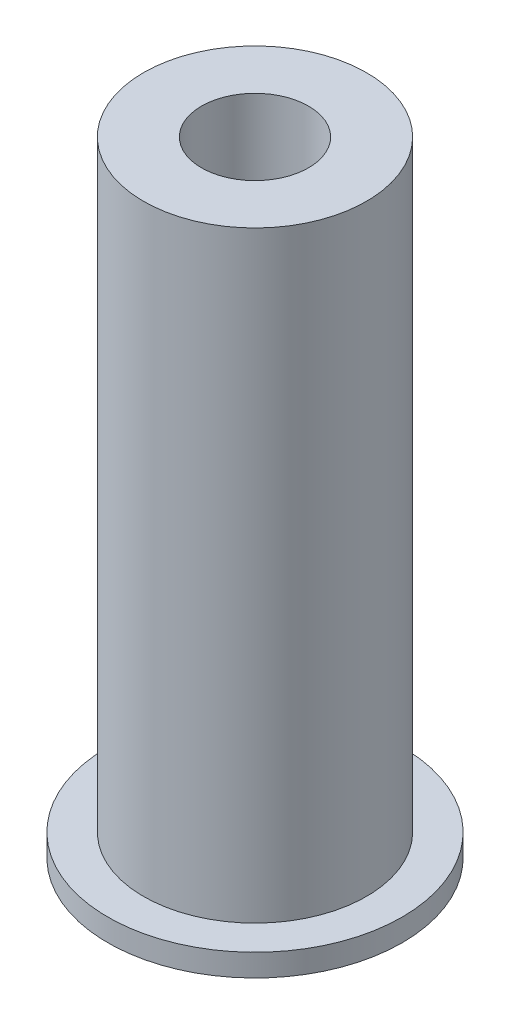
ISO-10303-21;
HEADER;
FILE_DESCRIPTION(('STEP AP214'),'2;1');
FILE_NAME('part.step','',(''),(''),'','','');
FILE_SCHEMA(('AUTOMOTIVE_DESIGN { 1 0 10303 214 1 1 1 1 }'));
ENDSEC;
DATA;
#1=APPLICATION_CONTEXT('core data for automotive mechanical design processes');
#2=APPLICATION_PROTOCOL_DEFINITION('international standard','automotive_design',2000,#1);
#3=PRODUCT_CONTEXT('',#1,'mechanical');
#4=PRODUCT('Part','Part','',(#3));
#5=PRODUCT_RELATED_PRODUCT_CATEGORY('part','',(#4));
#6=PRODUCT_DEFINITION_FORMATION('','',#4);
#7=PRODUCT_DEFINITION_CONTEXT('part definition',#1,'design');
#8=PRODUCT_DEFINITION('design','',#6,#7);
#9=PRODUCT_DEFINITION_SHAPE('','',#8);
#10=(LENGTH_UNIT() NAMED_UNIT(*) SI_UNIT(.MILLI.,.METRE.));
#11=(NAMED_UNIT(*) PLANE_ANGLE_UNIT() SI_UNIT($,.RADIAN.));
#12=(NAMED_UNIT(*) SI_UNIT($,.STERADIAN.) SOLID_ANGLE_UNIT());
#13=UNCERTAINTY_MEASURE_WITH_UNIT(LENGTH_MEASURE(1.E-05),#10,'distance_accuracy_value','');
#14=(GEOMETRIC_REPRESENTATION_CONTEXT(3) GLOBAL_UNCERTAINTY_ASSIGNED_CONTEXT((#13)) GLOBAL_UNIT_ASSIGNED_CONTEXT((#10,
#11,#12)) REPRESENTATION_CONTEXT('',''));
#15=CARTESIAN_POINT('',(0.,0.,0.));
#16=DIRECTION('',(0.,0.,1.));
#17=DIRECTION('',(1.,0.,0.));
#18=AXIS2_PLACEMENT_3D('',#15,#16,#17);
#19=CARTESIAN_POINT('',(0.,0.,0.));
#20=DIRECTION('',(0.,1.,0.));
#21=DIRECTION('',(-1.,0.,0.));
#22=AXIS2_PLACEMENT_3D('',#19,#20,#21);
#23=CYLINDRICAL_SURFACE('',#22,4.99999999999999);
#24=CARTESIAN_POINT('',(0.,-35.,0.));
#25=DIRECTION('',(0.,1.,0.));
#26=DIRECTION('',(-1.,0.,0.));
#27=AXIS2_PLACEMENT_3D('',#24,#25,#26);
#28=CIRCLE('',#27,5.);
#29=CARTESIAN_POINT('',(-4.99999999999998,-35.,0.));
#30=VERTEX_POINT('',#29);
#31=EDGE_CURVE('E68',#30,#30,#28,.T.);
#32=ORIENTED_EDGE('',*,*,#31,.F.);
#33=EDGE_LOOP('',(#32));
#34=FACE_BOUND('',#33,.T.);
#35=CARTESIAN_POINT('',(0.,-17.,0.));
#36=DIRECTION('',(0.,1.,0.));
#37=DIRECTION('',(-1.,0.,0.));
#38=AXIS2_PLACEMENT_3D('',#35,#36,#37);
#39=CIRCLE('',#38,4.99999999999999);
#40=CARTESIAN_POINT('',(-4.99999999999998,-17.,0.));
#41=VERTEX_POINT('',#40);
#42=EDGE_CURVE('E12',#41,#41,#39,.T.);
#43=ORIENTED_EDGE('',*,*,#42,.T.);
#44=EDGE_LOOP('',(#43));
#45=FACE_BOUND('',#44,.T.);
#46=ADVANCED_FACE('F40',(#34,#45),#23,.F.);
#47=CARTESIAN_POINT('',(0.,-17.,0.));
#48=DIRECTION('',(0.,1.,0.));
#49=DIRECTION('',(-1.,0.,0.));
#50=AXIS2_PLACEMENT_3D('',#47,#48,#49);
#51=PLANE('',#50);
#52=ORIENTED_EDGE('',*,*,#42,.F.);
#53=EDGE_LOOP('',(#52));
#54=FACE_BOUND('',#53,.T.);
#55=CARTESIAN_POINT('',(0.,-17.,0.));
#56=DIRECTION('',(0.,1.,0.));
#57=DIRECTION('',(-1.,0.,0.));
#58=AXIS2_PLACEMENT_3D('',#55,#56,#57);
#59=CIRCLE('',#58,3.);
#60=CARTESIAN_POINT('',(-2.99999999999999,-17.,0.));
#61=VERTEX_POINT('',#60);
#62=EDGE_CURVE('E46',#61,#61,#59,.T.);
#63=ORIENTED_EDGE('',*,*,#62,.T.);
#64=EDGE_LOOP('',(#63));
#65=FACE_BOUND('',#64,.T.);
#66=ADVANCED_FACE('F76',(#54,#65),#51,.F.);
#67=CARTESIAN_POINT('',(0.,0.,0.));
#68=DIRECTION('',(0.,1.,0.));
#69=DIRECTION('',(-1.,0.,0.));
#70=AXIS2_PLACEMENT_3D('',#67,#68,#69);
#71=CYLINDRICAL_SURFACE('',#70,2.99999999999999);
#72=ORIENTED_EDGE('',*,*,#62,.F.);
#73=EDGE_LOOP('',(#72));
#74=FACE_BOUND('',#73,.T.);
#75=CARTESIAN_POINT('',(0.,0.,0.));
#76=DIRECTION('',(0.,1.,0.));
#77=DIRECTION('',(-1.,0.,0.));
#78=AXIS2_PLACEMENT_3D('',#75,#76,#77);
#79=CIRCLE('',#78,2.99999999999998);
#80=CARTESIAN_POINT('',(-2.99999999999998,0.,0.));
#81=VERTEX_POINT('',#80);
#82=EDGE_CURVE('E50',#81,#81,#79,.T.);
#83=ORIENTED_EDGE('',*,*,#82,.T.);
#84=EDGE_LOOP('',(#83));
#85=FACE_BOUND('',#84,.T.);
#86=ADVANCED_FACE('F80',(#74,#85),#71,.F.);
#87=CARTESIAN_POINT('',(0.,0.,0.));
#88=DIRECTION('',(0.,-1.,0.));
#89=DIRECTION('',(1.,0.,0.));
#90=AXIS2_PLACEMENT_3D('',#87,#88,#89);
#91=PLANE('',#90);
#92=ORIENTED_EDGE('',*,*,#82,.F.);
#93=EDGE_LOOP('',(#92));
#94=FACE_BOUND('',#93,.T.);
#95=CARTESIAN_POINT('',(0.,0.,0.));
#96=DIRECTION('',(0.,1.,0.));
#97=DIRECTION('',(-1.,0.,0.));
#98=AXIS2_PLACEMENT_3D('',#95,#96,#97);
#99=CIRCLE('',#98,6.24999999999998);
#100=CARTESIAN_POINT('',(-6.24999999999998,0.,0.));
#101=VERTEX_POINT('',#100);
#102=EDGE_CURVE('E54',#101,#101,#99,.T.);
#103=ORIENTED_EDGE('',*,*,#102,.T.);
#104=EDGE_LOOP('',(#103));
#105=FACE_BOUND('',#104,.T.);
#106=ADVANCED_FACE('F85',(#94,#105),#91,.F.);
#107=CARTESIAN_POINT('',(0.,0.,0.));
#108=DIRECTION('',(0.,1.,0.));
#109=DIRECTION('',(-1.,0.,0.));
#110=AXIS2_PLACEMENT_3D('',#107,#108,#109);
#111=CYLINDRICAL_SURFACE('',#110,6.24999999999999);
#112=ORIENTED_EDGE('',*,*,#102,.F.);
#113=EDGE_LOOP('',(#112));
#114=FACE_BOUND('',#113,.T.);
#115=CARTESIAN_POINT('',(0.,-33.75,0.));
#116=DIRECTION('',(0.,1.,0.));
#117=DIRECTION('',(-1.,0.,0.));
#118=AXIS2_PLACEMENT_3D('',#115,#116,#117);
#119=CIRCLE('',#118,6.25);
#120=CARTESIAN_POINT('',(-6.24999999999998,-33.75,0.));
#121=VERTEX_POINT('',#120);
#122=EDGE_CURVE('E59',#121,#121,#119,.T.);
#123=ORIENTED_EDGE('',*,*,#122,.T.);
#124=EDGE_LOOP('',(#123));
#125=FACE_BOUND('',#124,.T.);
#126=ADVANCED_FACE('F91',(#114,#125),#111,.T.);
#127=CARTESIAN_POINT('',(0.,-33.75,0.));
#128=DIRECTION('',(0.,1.,0.));
#129=DIRECTION('',(-1.,0.,0.));
#130=AXIS2_PLACEMENT_3D('',#127,#128,#129);
#131=PLANE('',#130);
#132=CARTESIAN_POINT('',(0.,-33.75,0.));
#133=DIRECTION('',(0.,1.,0.));
#134=DIRECTION('',(-1.,0.,0.));
#135=AXIS2_PLACEMENT_3D('',#132,#133,#134);
#136=CIRCLE('',#135,8.25000000000001);
#137=CARTESIAN_POINT('',(-8.24999999999999,-33.75,0.));
#138=VERTEX_POINT('',#137);
#139=EDGE_CURVE('E62',#138,#138,#136,.T.);
#140=ORIENTED_EDGE('',*,*,#139,.T.);
#141=EDGE_LOOP('',(#140));
#142=FACE_BOUND('',#141,.T.);
#143=ORIENTED_EDGE('',*,*,#122,.F.);
#144=EDGE_LOOP('',(#143));
#145=FACE_BOUND('',#144,.T.);
#146=ADVANCED_FACE('F95',(#142,#145),#131,.T.);
#147=CARTESIAN_POINT('',(0.,0.,0.));
#148=DIRECTION('',(0.,1.,0.));
#149=DIRECTION('',(-1.,0.,0.));
#150=AXIS2_PLACEMENT_3D('',#147,#148,#149);
#151=CYLINDRICAL_SURFACE('',#150,8.25000000000001);
#152=CARTESIAN_POINT('',(0.,-35.,0.));
#153=DIRECTION('',(0.,1.,0.));
#154=DIRECTION('',(-1.,0.,0.));
#155=AXIS2_PLACEMENT_3D('',#152,#153,#154);
#156=CIRCLE('',#155,8.25000000000001);
#157=CARTESIAN_POINT('',(-8.24999999999999,-35.,0.));
#158=VERTEX_POINT('',#157);
#159=EDGE_CURVE('E65',#158,#158,#156,.T.);
#160=ORIENTED_EDGE('',*,*,#159,.T.);
#161=EDGE_LOOP('',(#160));
#162=FACE_BOUND('',#161,.T.);
#163=ORIENTED_EDGE('',*,*,#139,.F.);
#164=EDGE_LOOP('',(#163));
#165=FACE_BOUND('',#164,.T.);
#166=ADVANCED_FACE('F99',(#162,#165),#151,.T.);
#167=CARTESIAN_POINT('',(0.,-35.,0.));
#168=DIRECTION('',(0.,-1.,0.));
#169=DIRECTION('',(1.,0.,0.));
#170=AXIS2_PLACEMENT_3D('',#167,#168,#169);
#171=PLANE('',#170);
#172=ORIENTED_EDGE('',*,*,#31,.T.);
#173=EDGE_LOOP('',(#172));
#174=FACE_BOUND('',#173,.T.);
#175=ORIENTED_EDGE('',*,*,#159,.F.);
#176=EDGE_LOOP('',(#175));
#177=FACE_BOUND('',#176,.T.);
#178=ADVANCED_FACE('F72',(#174,#177),#171,.T.);
#179=CLOSED_SHELL('',(#46,#66,#86,#106,#126,#146,#166,#178));
#180=MANIFOLD_SOLID_BREP('B2',#179);
#181=ADVANCED_BREP_SHAPE_REPRESENTATION('',(#18,#180),#14);
#182=SHAPE_DEFINITION_REPRESENTATION(#9,#181);
ENDSEC;
END-ISO-10303-21;
